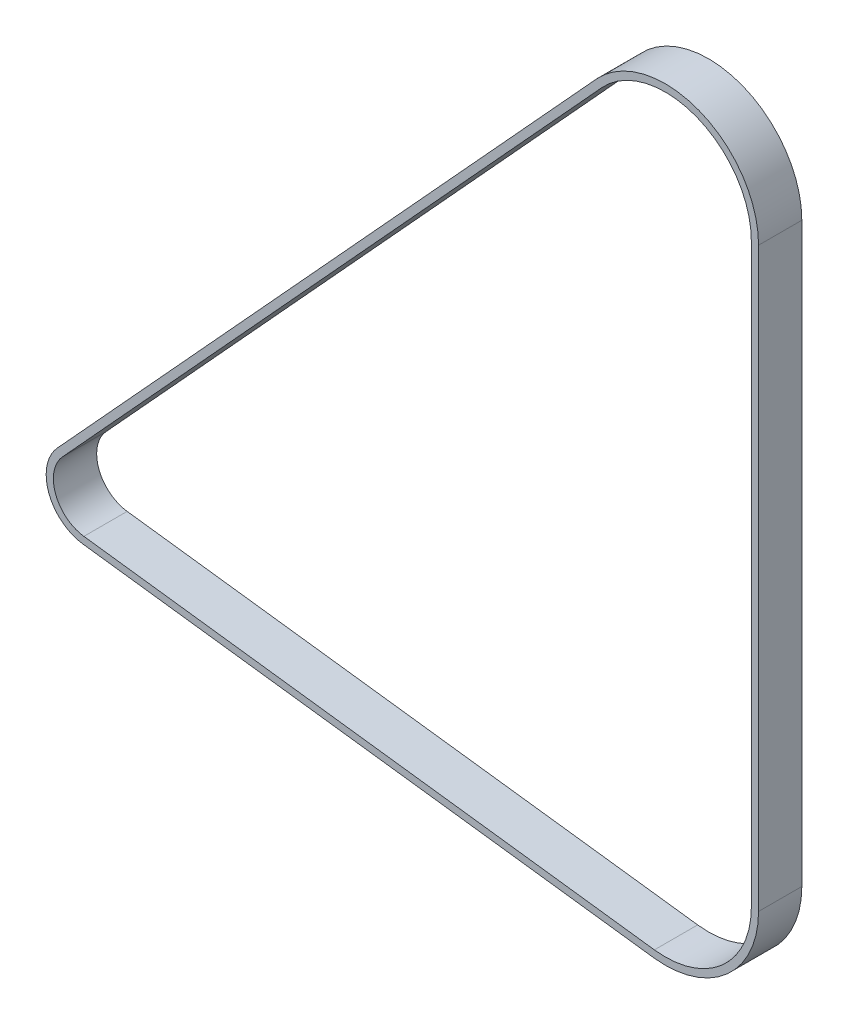
ISO-10303-21;
HEADER;
FILE_DESCRIPTION(('STEP AP214'),'2;1');
FILE_NAME('part.step','',(''),(''),'','','');
FILE_SCHEMA(('AUTOMOTIVE_DESIGN { 1 0 10303 214 1 1 1 1 }'));
ENDSEC;
DATA;
#1=APPLICATION_CONTEXT('core data for automotive mechanical design processes');
#2=APPLICATION_PROTOCOL_DEFINITION('international standard','automotive_design',2000,#1);
#3=PRODUCT_CONTEXT('',#1,'mechanical');
#4=PRODUCT('Part','Part','',(#3));
#5=PRODUCT_RELATED_PRODUCT_CATEGORY('part','',(#4));
#6=PRODUCT_DEFINITION_FORMATION('','',#4);
#7=PRODUCT_DEFINITION_CONTEXT('part definition',#1,'design');
#8=PRODUCT_DEFINITION('design','',#6,#7);
#9=PRODUCT_DEFINITION_SHAPE('','',#8);
#10=(LENGTH_UNIT() NAMED_UNIT(*) SI_UNIT(.MILLI.,.METRE.));
#11=(NAMED_UNIT(*) PLANE_ANGLE_UNIT() SI_UNIT($,.RADIAN.));
#12=(NAMED_UNIT(*) SI_UNIT($,.STERADIAN.) SOLID_ANGLE_UNIT());
#13=UNCERTAINTY_MEASURE_WITH_UNIT(LENGTH_MEASURE(1.E-05),#10,'distance_accuracy_value','');
#14=(GEOMETRIC_REPRESENTATION_CONTEXT(3) GLOBAL_UNCERTAINTY_ASSIGNED_CONTEXT((#13)) GLOBAL_UNIT_ASSIGNED_CONTEXT((#10,
#11,#12)) REPRESENTATION_CONTEXT('',''));
#15=CARTESIAN_POINT('',(0.,0.,0.));
#16=DIRECTION('',(0.,0.,1.));
#17=DIRECTION('',(1.,0.,0.));
#18=AXIS2_PLACEMENT_3D('',#15,#16,#17);
#19=CARTESIAN_POINT('',(0.,0.,4.7625));
#20=DIRECTION('',(0.,0.,1.));
#21=DIRECTION('',(1.,0.,0.));
#22=AXIS2_PLACEMENT_3D('',#19,#20,#21);
#23=PLANE('',#22);
#24=CARTESIAN_POINT('',(0.,0.,4.7625));
#25=DIRECTION('',(0.,0.,1.));
#26=DIRECTION('',(1.,0.,0.));
#27=AXIS2_PLACEMENT_3D('',#24,#25,#26);
#28=CIRCLE('',#27,9.27713763125415);
#29=CARTESIAN_POINT('',(-6.84414442825489,6.26282441670045,4.7625));
#30=VERTEX_POINT('',#29);
#31=CARTESIAN_POINT('',(-1.17539794981841,-9.20237590455827,4.7625));
#32=VERTEX_POINT('',#31);
#33=EDGE_CURVE('E209',#30,#32,#28,.T.);
#34=ORIENTED_EDGE('',*,*,#33,.T.);
#35=DIRECTION('',(0.991941293783977,-0.126698341292099,0.));
#36=VECTOR('',#35,1.);
#37=CARTESIAN_POINT('',(-1.17539794981841,-9.20237590455827,4.7625));
#38=LINE('',#37,#36);
#39=CARTESIAN_POINT('',(124.399062652258,-25.2417080370484,4.7625));
#40=VERTEX_POINT('',#39);
#41=EDGE_CURVE('E212',#32,#40,#38,.T.);
#42=ORIENTED_EDGE('',*,*,#41,.T.);
#43=CARTESIAN_POINT('',(127.,-4.87855938444014,4.7625));
#44=DIRECTION('',(0.,0.,1.));
#45=DIRECTION('',(1.,0.,0.));
#46=AXIS2_PLACEMENT_3D('',#43,#44,#45);
#47=CIRCLE('',#46,20.5285824677472);
#48=CARTESIAN_POINT('',(147.528582467747,-4.87855938444013,4.7625));
#49=VERTEX_POINT('',#48);
#50=EDGE_CURVE('E215',#40,#49,#47,.T.);
#51=ORIENTED_EDGE('',*,*,#50,.T.);
#52=DIRECTION('',(0.,1.,0.));
#53=VECTOR('',#52,1.);
#54=CARTESIAN_POINT('',(147.528582467747,-4.87855938444014,4.7625));
#55=LINE('',#54,#53);
#56=CARTESIAN_POINT('',(147.528582467747,122.12144061556,4.7625));
#57=VERTEX_POINT('',#56);
#58=EDGE_CURVE('E217',#49,#57,#55,.T.);
#59=ORIENTED_EDGE('',*,*,#58,.T.);
#60=CARTESIAN_POINT('',(127.,122.12144061556,4.7625));
#61=DIRECTION('',(0.,0.,1.));
#62=DIRECTION('',(1.,0.,0.));
#63=AXIS2_PLACEMENT_3D('',#60,#61,#62);
#64=CIRCLE('',#63,20.5285824677472);
#65=CARTESIAN_POINT('',(111.855179592974,135.979907809808,4.7625));
#66=VERTEX_POINT('',#65);
#67=EDGE_CURVE('E219',#57,#66,#64,.T.);
#68=ORIENTED_EDGE('',*,*,#67,.T.);
#69=DIRECTION('',(-0.675081546230526,-0.737743116497201,0.));
#70=VECTOR('',#69,1.);
#71=CARTESIAN_POINT('',(111.855179592974,135.979907809808,4.7625));
#72=LINE('',#71,#70);
#73=EDGE_CURVE('E221',#66,#30,#72,.T.);
#74=ORIENTED_EDGE('',*,*,#73,.T.);
#75=EDGE_LOOP('',(#34,#42,#51,#59,#68,#74));
#76=FACE_BOUND('',#75,.T.);
#77=DIRECTION('',(0.991941293783977,-0.126698341292099,0.));
#78=VECTOR('',#77,1.);
#79=CARTESIAN_POINT('',(-0.974264333017205,-7.6276691006762,4.7625));
#80=LINE('',#79,#78);
#81=CARTESIAN_POINT('',(-0.974264333017205,-7.6276691006762,4.7625));
#82=VERTEX_POINT('',#81);
#83=CARTESIAN_POINT('',(124.60019626906,-23.6670012331663,4.7625));
#84=VERTEX_POINT('',#83);
#85=EDGE_CURVE('E166',#82,#84,#80,.T.);
#86=ORIENTED_EDGE('',*,*,#85,.F.);
#87=CARTESIAN_POINT('',(0.,0.,4.7625));
#88=DIRECTION('',(0.,0.,1.));
#89=DIRECTION('',(1.,0.,0.));
#90=AXIS2_PLACEMENT_3D('',#87,#88,#89);
#91=CIRCLE('',#90,7.68963763125415);
#92=CARTESIAN_POINT('',(-5.67297723081559,5.19113246205949,4.7625));
#93=VERTEX_POINT('',#92);
#94=EDGE_CURVE('E158',#93,#82,#91,.T.);
#95=ORIENTED_EDGE('',*,*,#94,.F.);
#96=DIRECTION('',(-0.675081546230526,-0.737743116497201,0.));
#97=VECTOR('',#96,1.);
#98=CARTESIAN_POINT('',(113.026346790414,134.908215855167,4.7625));
#99=LINE('',#98,#97);
#100=CARTESIAN_POINT('',(113.026346790414,134.908215855167,4.7625));
#101=VERTEX_POINT('',#100);
#102=EDGE_CURVE('E187',#101,#93,#99,.T.);
#103=ORIENTED_EDGE('',*,*,#102,.F.);
#104=CARTESIAN_POINT('',(127.,122.12144061556,4.7625));
#105=DIRECTION('',(0.,0.,1.));
#106=DIRECTION('',(1.,0.,0.));
#107=AXIS2_PLACEMENT_3D('',#104,#105,#106);
#108=CIRCLE('',#107,18.9410824677472);
#109=CARTESIAN_POINT('',(145.941082467747,122.12144061556,4.7625));
#110=VERTEX_POINT('',#109);
#111=EDGE_CURVE('E185',#110,#101,#108,.T.);
#112=ORIENTED_EDGE('',*,*,#111,.F.);
#113=DIRECTION('',(0.,1.,0.));
#114=VECTOR('',#113,1.);
#115=CARTESIAN_POINT('',(145.941082467747,-4.87855938444014,4.7625));
#116=LINE('',#115,#114);
#117=CARTESIAN_POINT('',(145.941082467747,-4.87855938444014,4.7625));
#118=VERTEX_POINT('',#117);
#119=EDGE_CURVE('E181',#118,#110,#116,.T.);
#120=ORIENTED_EDGE('',*,*,#119,.F.);
#121=CARTESIAN_POINT('',(127.,-4.87855938444014,4.7625));
#122=DIRECTION('',(0.,0.,1.));
#123=DIRECTION('',(1.,0.,0.));
#124=AXIS2_PLACEMENT_3D('',#121,#122,#123);
#125=CIRCLE('',#124,18.9410824677472);
#126=EDGE_CURVE('E179',#84,#118,#125,.T.);
#127=ORIENTED_EDGE('',*,*,#126,.F.);
#128=EDGE_LOOP('',(#86,#95,#103,#112,#120,#127));
#129=FACE_BOUND('',#128,.T.);
#130=ADVANCED_FACE('F69',(#76,#129),#23,.T.);
#131=CARTESIAN_POINT('',(0.,0.,-4.7625));
#132=DIRECTION('',(0.,0.,1.));
#133=DIRECTION('',(1.,0.,0.));
#134=AXIS2_PLACEMENT_3D('',#131,#132,#133);
#135=PLANE('',#134);
#136=CARTESIAN_POINT('',(0.,0.,-4.7625));
#137=DIRECTION('',(0.,0.,1.));
#138=DIRECTION('',(1.,0.,0.));
#139=AXIS2_PLACEMENT_3D('',#136,#137,#138);
#140=CIRCLE('',#139,9.27713763125415);
#141=CARTESIAN_POINT('',(-6.84414442825489,6.26282441670045,-4.7625));
#142=VERTEX_POINT('',#141);
#143=CARTESIAN_POINT('',(-1.17539794981841,-9.20237590455827,-4.7625));
#144=VERTEX_POINT('',#143);
#145=EDGE_CURVE('E174',#142,#144,#140,.T.);
#146=ORIENTED_EDGE('',*,*,#145,.F.);
#147=DIRECTION('',(-0.675081546230526,-0.737743116497201,0.));
#148=VECTOR('',#147,1.);
#149=CARTESIAN_POINT('',(111.855179592974,135.979907809808,-4.7625));
#150=LINE('',#149,#148);
#151=CARTESIAN_POINT('',(111.855179592974,135.979907809808,-4.7625));
#152=VERTEX_POINT('',#151);
#153=EDGE_CURVE('E213',#152,#142,#150,.T.);
#154=ORIENTED_EDGE('',*,*,#153,.F.);
#155=CARTESIAN_POINT('',(127.,122.12144061556,-4.7625));
#156=DIRECTION('',(0.,0.,1.));
#157=DIRECTION('',(1.,0.,0.));
#158=AXIS2_PLACEMENT_3D('',#155,#156,#157);
#159=CIRCLE('',#158,20.5285824677472);
#160=CARTESIAN_POINT('',(147.528582467747,122.12144061556,-4.7625));
#161=VERTEX_POINT('',#160);
#162=EDGE_CURVE('E232',#161,#152,#159,.T.);
#163=ORIENTED_EDGE('',*,*,#162,.F.);
#164=DIRECTION('',(0.,1.,0.));
#165=VECTOR('',#164,1.);
#166=CARTESIAN_POINT('',(147.528582467747,-4.87855938444014,-4.7625));
#167=LINE('',#166,#165);
#168=CARTESIAN_POINT('',(147.528582467747,-4.87855938444013,-4.7625));
#169=VERTEX_POINT('',#168);
#170=EDGE_CURVE('E230',#169,#161,#167,.T.);
#171=ORIENTED_EDGE('',*,*,#170,.F.);
#172=CARTESIAN_POINT('',(127.,-4.87855938444014,-4.7625));
#173=DIRECTION('',(0.,0.,1.));
#174=DIRECTION('',(1.,0.,0.));
#175=AXIS2_PLACEMENT_3D('',#172,#173,#174);
#176=CIRCLE('',#175,20.5285824677472);
#177=CARTESIAN_POINT('',(124.399062652258,-25.2417080370484,-4.7625));
#178=VERTEX_POINT('',#177);
#179=EDGE_CURVE('E228',#178,#169,#176,.T.);
#180=ORIENTED_EDGE('',*,*,#179,.F.);
#181=DIRECTION('',(0.991941293783977,-0.126698341292099,0.));
#182=VECTOR('',#181,1.);
#183=CARTESIAN_POINT('',(-1.17539794981841,-9.20237590455827,-4.7625));
#184=LINE('',#183,#182);
#185=EDGE_CURVE('E226',#144,#178,#184,.T.);
#186=ORIENTED_EDGE('',*,*,#185,.F.);
#187=EDGE_LOOP('',(#146,#154,#163,#171,#180,#186));
#188=FACE_BOUND('',#187,.T.);
#189=CARTESIAN_POINT('',(0.,0.,-4.7625));
#190=DIRECTION('',(0.,0.,1.));
#191=DIRECTION('',(1.,0.,0.));
#192=AXIS2_PLACEMENT_3D('',#189,#190,#191);
#193=CIRCLE('',#192,7.68963763125415);
#194=CARTESIAN_POINT('',(-5.67297723081558,5.19113246205949,-4.7625));
#195=VERTEX_POINT('',#194);
#196=CARTESIAN_POINT('',(-0.974264333017205,-7.6276691006762,-4.7625));
#197=VERTEX_POINT('',#196);
#198=EDGE_CURVE('E92',#195,#197,#193,.T.);
#199=ORIENTED_EDGE('',*,*,#198,.T.);
#200=DIRECTION('',(0.991941293783977,-0.126698341292099,0.));
#201=VECTOR('',#200,1.);
#202=CARTESIAN_POINT('',(-0.974264333017205,-7.6276691006762,-4.7625));
#203=LINE('',#202,#201);
#204=CARTESIAN_POINT('',(124.60019626906,-23.6670012331663,-4.7625));
#205=VERTEX_POINT('',#204);
#206=EDGE_CURVE('E173',#197,#205,#203,.T.);
#207=ORIENTED_EDGE('',*,*,#206,.T.);
#208=CARTESIAN_POINT('',(127.,-4.87855938444014,-4.7625));
#209=DIRECTION('',(0.,0.,1.));
#210=DIRECTION('',(1.,0.,0.));
#211=AXIS2_PLACEMENT_3D('',#208,#209,#210);
#212=CIRCLE('',#211,18.9410824677472);
#213=CARTESIAN_POINT('',(145.941082467747,-4.87855938444014,-4.7625));
#214=VERTEX_POINT('',#213);
#215=EDGE_CURVE('E191',#205,#214,#212,.T.);
#216=ORIENTED_EDGE('',*,*,#215,.T.);
#217=DIRECTION('',(0.,1.,0.));
#218=VECTOR('',#217,1.);
#219=CARTESIAN_POINT('',(145.941082467747,-4.87855938444014,-4.7625));
#220=LINE('',#219,#218);
#221=CARTESIAN_POINT('',(145.941082467747,122.12144061556,-4.7625));
#222=VERTEX_POINT('',#221);
#223=EDGE_CURVE('E194',#214,#222,#220,.T.);
#224=ORIENTED_EDGE('',*,*,#223,.T.);
#225=CARTESIAN_POINT('',(127.,122.12144061556,-4.7625));
#226=DIRECTION('',(0.,0.,1.));
#227=DIRECTION('',(1.,0.,0.));
#228=AXIS2_PLACEMENT_3D('',#225,#226,#227);
#229=CIRCLE('',#228,18.9410824677472);
#230=CARTESIAN_POINT('',(113.026346790414,134.908215855167,-4.7625));
#231=VERTEX_POINT('',#230);
#232=EDGE_CURVE('E197',#222,#231,#229,.T.);
#233=ORIENTED_EDGE('',*,*,#232,.T.);
#234=DIRECTION('',(-0.675081546230526,-0.737743116497201,0.));
#235=VECTOR('',#234,1.);
#236=CARTESIAN_POINT('',(113.026346790414,134.908215855167,-4.7625));
#237=LINE('',#236,#235);
#238=EDGE_CURVE('E167',#231,#195,#237,.T.);
#239=ORIENTED_EDGE('',*,*,#238,.T.);
#240=EDGE_LOOP('',(#199,#207,#216,#224,#233,#239));
#241=FACE_BOUND('',#240,.T.);
#242=ADVANCED_FACE('F256',(#188,#241),#135,.F.);
#243=CARTESIAN_POINT('',(0.,0.,4.7625));
#244=DIRECTION('',(0.,0.,-1.));
#245=DIRECTION('',(-1.,0.,0.));
#246=AXIS2_PLACEMENT_3D('',#243,#244,#245);
#247=CYLINDRICAL_SURFACE('',#246,9.27713763125415);
#248=ORIENTED_EDGE('',*,*,#145,.T.);
#249=DIRECTION('',(0.,0.,-1.));
#250=VECTOR('',#249,1.);
#251=CARTESIAN_POINT('',(-1.17539794981841,-9.20237590455827,4.7625));
#252=LINE('',#251,#250);
#253=EDGE_CURVE('E12',#32,#144,#252,.T.);
#254=ORIENTED_EDGE('',*,*,#253,.F.);
#255=ORIENTED_EDGE('',*,*,#33,.F.);
#256=DIRECTION('',(0.,0.,-1.));
#257=VECTOR('',#256,1.);
#258=CARTESIAN_POINT('',(-6.84414442825489,6.26282441670045,4.7625));
#259=LINE('',#258,#257);
#260=EDGE_CURVE('E223',#30,#142,#259,.T.);
#261=ORIENTED_EDGE('',*,*,#260,.T.);
#262=EDGE_LOOP('',(#248,#254,#255,#261));
#263=FACE_BOUND('',#262,.T.);
#264=ADVANCED_FACE('F71',(#263),#247,.T.);
#265=CARTESIAN_POINT('',(-1.17539794981841,-9.20237590455827,4.7625));
#266=DIRECTION('',(0.126698341292099,0.991941293783977,0.));
#267=DIRECTION('',(-0.991941293783977,0.126698341292099,0.));
#268=AXIS2_PLACEMENT_3D('',#265,#266,#267);
#269=PLANE('',#268);
#270=ORIENTED_EDGE('',*,*,#185,.T.);
#271=DIRECTION('',(0.,0.,-1.));
#272=VECTOR('',#271,1.);
#273=CARTESIAN_POINT('',(124.399062652258,-25.2417080370484,4.7625));
#274=LINE('',#273,#272);
#275=EDGE_CURVE('E77',#40,#178,#274,.T.);
#276=ORIENTED_EDGE('',*,*,#275,.F.);
#277=ORIENTED_EDGE('',*,*,#41,.F.);
#278=ORIENTED_EDGE('',*,*,#253,.T.);
#279=EDGE_LOOP('',(#270,#276,#277,#278));
#280=FACE_BOUND('',#279,.T.);
#281=ADVANCED_FACE('F273',(#280),#269,.F.);
#282=CARTESIAN_POINT('',(127.,-4.87855938444014,4.7625));
#283=DIRECTION('',(0.,0.,-1.));
#284=DIRECTION('',(-1.,0.,0.));
#285=AXIS2_PLACEMENT_3D('',#282,#283,#284);
#286=CYLINDRICAL_SURFACE('',#285,20.5285824677472);
#287=ORIENTED_EDGE('',*,*,#179,.T.);
#288=DIRECTION('',(0.,0.,-1.));
#289=VECTOR('',#288,1.);
#290=CARTESIAN_POINT('',(147.528582467747,-4.87855938444013,4.7625));
#291=LINE('',#290,#289);
#292=EDGE_CURVE('E243',#49,#169,#291,.T.);
#293=ORIENTED_EDGE('',*,*,#292,.F.);
#294=ORIENTED_EDGE('',*,*,#50,.F.);
#295=ORIENTED_EDGE('',*,*,#275,.T.);
#296=EDGE_LOOP('',(#287,#293,#294,#295));
#297=FACE_BOUND('',#296,.T.);
#298=ADVANCED_FACE('F250',(#297),#286,.T.);
#299=CARTESIAN_POINT('',(147.528582467747,-4.87855938444014,4.7625));
#300=DIRECTION('',(-1.,0.,0.));
#301=DIRECTION('',(0.,0.,1.));
#302=AXIS2_PLACEMENT_3D('',#299,#300,#301);
#303=PLANE('',#302);
#304=ORIENTED_EDGE('',*,*,#170,.T.);
#305=DIRECTION('',(0.,0.,-1.));
#306=VECTOR('',#305,1.);
#307=CARTESIAN_POINT('',(147.528582467747,122.12144061556,4.7625));
#308=LINE('',#307,#306);
#309=EDGE_CURVE('E240',#57,#161,#308,.T.);
#310=ORIENTED_EDGE('',*,*,#309,.F.);
#311=ORIENTED_EDGE('',*,*,#58,.F.);
#312=ORIENTED_EDGE('',*,*,#292,.T.);
#313=EDGE_LOOP('',(#304,#310,#311,#312));
#314=FACE_BOUND('',#313,.T.);
#315=ADVANCED_FACE('F262',(#314),#303,.F.);
#316=CARTESIAN_POINT('',(127.,122.12144061556,4.7625));
#317=DIRECTION('',(0.,0.,-1.));
#318=DIRECTION('',(-1.,0.,0.));
#319=AXIS2_PLACEMENT_3D('',#316,#317,#318);
#320=CYLINDRICAL_SURFACE('',#319,20.5285824677472);
#321=ORIENTED_EDGE('',*,*,#162,.T.);
#322=DIRECTION('',(0.,0.,-1.));
#323=VECTOR('',#322,1.);
#324=CARTESIAN_POINT('',(111.855179592974,135.979907809808,4.7625));
#325=LINE('',#324,#323);
#326=EDGE_CURVE('E237',#66,#152,#325,.T.);
#327=ORIENTED_EDGE('',*,*,#326,.F.);
#328=ORIENTED_EDGE('',*,*,#67,.F.);
#329=ORIENTED_EDGE('',*,*,#309,.T.);
#330=EDGE_LOOP('',(#321,#327,#328,#329));
#331=FACE_BOUND('',#330,.T.);
#332=ADVANCED_FACE('F266',(#331),#320,.T.);
#333=CARTESIAN_POINT('',(111.855179592974,135.979907809808,4.7625));
#334=DIRECTION('',(0.737743116497201,-0.675081546230526,0.));
#335=DIRECTION('',(0.675081546230526,0.737743116497201,0.));
#336=AXIS2_PLACEMENT_3D('',#333,#334,#335);
#337=PLANE('',#336);
#338=ORIENTED_EDGE('',*,*,#153,.T.);
#339=ORIENTED_EDGE('',*,*,#260,.F.);
#340=ORIENTED_EDGE('',*,*,#73,.F.);
#341=ORIENTED_EDGE('',*,*,#326,.T.);
#342=EDGE_LOOP('',(#338,#339,#340,#341));
#343=FACE_BOUND('',#342,.T.);
#344=ADVANCED_FACE('F276',(#343),#337,.F.);
#345=CARTESIAN_POINT('',(0.,0.,4.7625));
#346=DIRECTION('',(0.,0.,-1.));
#347=DIRECTION('',(-1.,0.,0.));
#348=AXIS2_PLACEMENT_3D('',#345,#346,#347);
#349=CYLINDRICAL_SURFACE('',#348,7.68963763125415);
#350=ORIENTED_EDGE('',*,*,#198,.F.);
#351=DIRECTION('',(0.,0.,-1.));
#352=VECTOR('',#351,1.);
#353=CARTESIAN_POINT('',(-5.67297723081559,5.19113246205949,4.7625));
#354=LINE('',#353,#352);
#355=EDGE_CURVE('E162',#93,#195,#354,.T.);
#356=ORIENTED_EDGE('',*,*,#355,.F.);
#357=ORIENTED_EDGE('',*,*,#94,.T.);
#358=DIRECTION('',(0.,0.,-1.));
#359=VECTOR('',#358,1.);
#360=CARTESIAN_POINT('',(-0.974264333017205,-7.6276691006762,4.7625));
#361=LINE('',#360,#359);
#362=EDGE_CURVE('E161',#82,#197,#361,.T.);
#363=ORIENTED_EDGE('',*,*,#362,.T.);
#364=EDGE_LOOP('',(#350,#356,#357,#363));
#365=FACE_BOUND('',#364,.T.);
#366=ADVANCED_FACE('F160',(#365),#349,.F.);
#367=CARTESIAN_POINT('',(-0.974264333017205,-7.6276691006762,4.7625));
#368=DIRECTION('',(0.126698341292099,0.991941293783977,0.));
#369=DIRECTION('',(-0.991941293783977,0.126698341292099,0.));
#370=AXIS2_PLACEMENT_3D('',#367,#368,#369);
#371=PLANE('',#370);
#372=ORIENTED_EDGE('',*,*,#206,.F.);
#373=ORIENTED_EDGE('',*,*,#362,.F.);
#374=ORIENTED_EDGE('',*,*,#85,.T.);
#375=DIRECTION('',(0.,0.,-1.));
#376=VECTOR('',#375,1.);
#377=CARTESIAN_POINT('',(124.60019626906,-23.6670012331663,4.7625));
#378=LINE('',#377,#376);
#379=EDGE_CURVE('E175',#84,#205,#378,.T.);
#380=ORIENTED_EDGE('',*,*,#379,.T.);
#381=EDGE_LOOP('',(#372,#373,#374,#380));
#382=FACE_BOUND('',#381,.T.);
#383=ADVANCED_FACE('F170',(#382),#371,.T.);
#384=CARTESIAN_POINT('',(127.,-4.87855938444014,4.7625));
#385=DIRECTION('',(0.,0.,-1.));
#386=DIRECTION('',(-1.,0.,0.));
#387=AXIS2_PLACEMENT_3D('',#384,#385,#386);
#388=CYLINDRICAL_SURFACE('',#387,18.9410824677472);
#389=ORIENTED_EDGE('',*,*,#215,.F.);
#390=ORIENTED_EDGE('',*,*,#379,.F.);
#391=ORIENTED_EDGE('',*,*,#126,.T.);
#392=DIRECTION('',(0.,0.,-1.));
#393=VECTOR('',#392,1.);
#394=CARTESIAN_POINT('',(145.941082467747,-4.87855938444014,4.7625));
#395=LINE('',#394,#393);
#396=EDGE_CURVE('E206',#118,#214,#395,.T.);
#397=ORIENTED_EDGE('',*,*,#396,.T.);
#398=EDGE_LOOP('',(#389,#390,#391,#397));
#399=FACE_BOUND('',#398,.T.);
#400=ADVANCED_FACE('F294',(#399),#388,.F.);
#401=CARTESIAN_POINT('',(145.941082467747,-4.87855938444014,4.7625));
#402=DIRECTION('',(-1.,0.,0.));
#403=DIRECTION('',(0.,0.,1.));
#404=AXIS2_PLACEMENT_3D('',#401,#402,#403);
#405=PLANE('',#404);
#406=ORIENTED_EDGE('',*,*,#223,.F.);
#407=ORIENTED_EDGE('',*,*,#396,.F.);
#408=ORIENTED_EDGE('',*,*,#119,.T.);
#409=DIRECTION('',(0.,0.,-1.));
#410=VECTOR('',#409,1.);
#411=CARTESIAN_POINT('',(145.941082467747,122.12144061556,4.7625));
#412=LINE('',#411,#410);
#413=EDGE_CURVE('E204',#110,#222,#412,.T.);
#414=ORIENTED_EDGE('',*,*,#413,.T.);
#415=EDGE_LOOP('',(#406,#407,#408,#414));
#416=FACE_BOUND('',#415,.T.);
#417=ADVANCED_FACE('F297',(#416),#405,.T.);
#418=CARTESIAN_POINT('',(127.,122.12144061556,4.7625));
#419=DIRECTION('',(0.,0.,-1.));
#420=DIRECTION('',(-1.,0.,0.));
#421=AXIS2_PLACEMENT_3D('',#418,#419,#420);
#422=CYLINDRICAL_SURFACE('',#421,18.9410824677472);
#423=ORIENTED_EDGE('',*,*,#232,.F.);
#424=ORIENTED_EDGE('',*,*,#413,.F.);
#425=ORIENTED_EDGE('',*,*,#111,.T.);
#426=DIRECTION('',(0.,0.,-1.));
#427=VECTOR('',#426,1.);
#428=CARTESIAN_POINT('',(113.026346790414,134.908215855167,4.7625));
#429=LINE('',#428,#427);
#430=EDGE_CURVE('E84',#101,#231,#429,.T.);
#431=ORIENTED_EDGE('',*,*,#430,.T.);
#432=EDGE_LOOP('',(#423,#424,#425,#431));
#433=FACE_BOUND('',#432,.T.);
#434=ADVANCED_FACE('F301',(#433),#422,.F.);
#435=CARTESIAN_POINT('',(113.026346790414,134.908215855167,4.7625));
#436=DIRECTION('',(0.737743116497201,-0.675081546230526,0.));
#437=DIRECTION('',(0.675081546230526,0.737743116497201,0.));
#438=AXIS2_PLACEMENT_3D('',#435,#436,#437);
#439=PLANE('',#438);
#440=ORIENTED_EDGE('',*,*,#238,.F.);
#441=ORIENTED_EDGE('',*,*,#430,.F.);
#442=ORIENTED_EDGE('',*,*,#102,.T.);
#443=ORIENTED_EDGE('',*,*,#355,.T.);
#444=EDGE_LOOP('',(#440,#441,#442,#443));
#445=FACE_BOUND('',#444,.T.);
#446=ADVANCED_FACE('F305',(#445),#439,.T.);
#447=CLOSED_SHELL('',(#130,#242,#264,#281,#298,#315,#332,#344,#366,#383,#400,#417,#434,#446));
#448=MANIFOLD_SOLID_BREP('B2',#447);
#449=ADVANCED_BREP_SHAPE_REPRESENTATION('',(#18,#448),#14);
#450=SHAPE_DEFINITION_REPRESENTATION(#9,#449);
ENDSEC;
END-ISO-10303-21;
